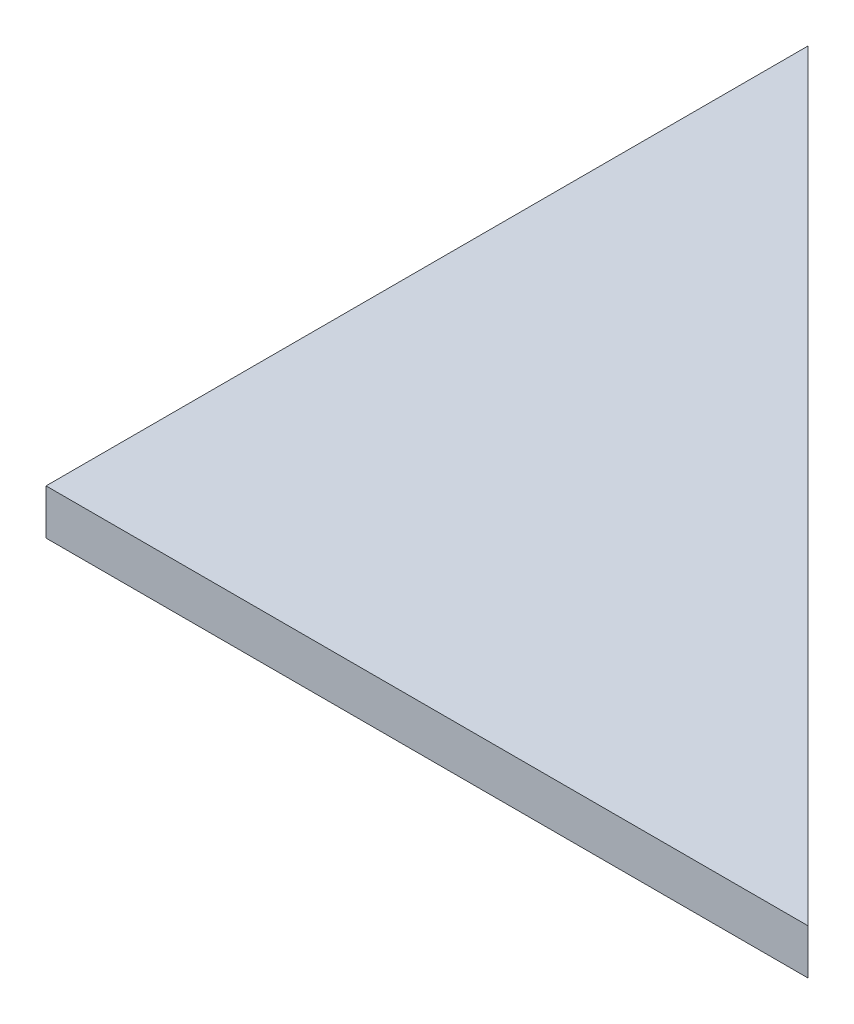
ISO-10303-21;
HEADER;
FILE_DESCRIPTION(('STEP AP214'),'2;1');
FILE_NAME('part.step','',(''),(''),'','','');
FILE_SCHEMA(('AUTOMOTIVE_DESIGN { 1 0 10303 214 1 1 1 1 }'));
ENDSEC;
DATA;
#1=APPLICATION_CONTEXT('core data for automotive mechanical design processes');
#2=APPLICATION_PROTOCOL_DEFINITION('international standard','automotive_design',2000,#1);
#3=PRODUCT_CONTEXT('',#1,'mechanical');
#4=PRODUCT('Part','Part','',(#3));
#5=PRODUCT_RELATED_PRODUCT_CATEGORY('part','',(#4));
#6=PRODUCT_DEFINITION_FORMATION('','',#4);
#7=PRODUCT_DEFINITION_CONTEXT('part definition',#1,'design');
#8=PRODUCT_DEFINITION('design','',#6,#7);
#9=PRODUCT_DEFINITION_SHAPE('','',#8);
#10=(LENGTH_UNIT() NAMED_UNIT(*) SI_UNIT(.MILLI.,.METRE.));
#11=(NAMED_UNIT(*) PLANE_ANGLE_UNIT() SI_UNIT($,.RADIAN.));
#12=(NAMED_UNIT(*) SI_UNIT($,.STERADIAN.) SOLID_ANGLE_UNIT());
#13=UNCERTAINTY_MEASURE_WITH_UNIT(LENGTH_MEASURE(1.E-05),#10,'distance_accuracy_value','');
#14=(GEOMETRIC_REPRESENTATION_CONTEXT(3) GLOBAL_UNCERTAINTY_ASSIGNED_CONTEXT((#13)) GLOBAL_UNIT_ASSIGNED_CONTEXT((#10,
#11,#12)) REPRESENTATION_CONTEXT('',''));
#15=CARTESIAN_POINT('',(0.,0.,0.));
#16=DIRECTION('',(0.,0.,1.));
#17=DIRECTION('',(1.,0.,0.));
#18=AXIS2_PLACEMENT_3D('',#15,#16,#17);
#19=CARTESIAN_POINT('',(0.,3.,-50.5));
#20=DIRECTION('',(1.,0.,0.));
#21=DIRECTION('',(0.,0.,-1.));
#22=AXIS2_PLACEMENT_3D('',#19,#20,#21);
#23=PLANE('',#22);
#24=DIRECTION('',(0.,0.,1.));
#25=VECTOR('',#24,1.);
#26=CARTESIAN_POINT('',(0.,0.,-50.5));
#27=LINE('',#26,#25);
#28=CARTESIAN_POINT('',(0.,0.,-50.5));
#29=VERTEX_POINT('',#28);
#30=CARTESIAN_POINT('',(0.,0.,0.));
#31=VERTEX_POINT('',#30);
#32=EDGE_CURVE('E83',#29,#31,#27,.T.);
#33=ORIENTED_EDGE('',*,*,#32,.T.);
#34=DIRECTION('',(0.,-1.,0.));
#35=VECTOR('',#34,1.);
#36=CARTESIAN_POINT('',(0.,3.,0.));
#37=LINE('',#36,#35);
#38=CARTESIAN_POINT('',(0.,3.,0.));
#39=VERTEX_POINT('',#38);
#40=EDGE_CURVE('E11',#39,#31,#37,.T.);
#41=ORIENTED_EDGE('',*,*,#40,.F.);
#42=DIRECTION('',(0.,0.,1.));
#43=VECTOR('',#42,1.);
#44=CARTESIAN_POINT('',(0.,3.,-50.5));
#45=LINE('',#44,#43);
#46=CARTESIAN_POINT('',(0.,3.,-50.5));
#47=VERTEX_POINT('',#46);
#48=EDGE_CURVE('E76',#47,#39,#45,.T.);
#49=ORIENTED_EDGE('',*,*,#48,.F.);
#50=DIRECTION('',(0.,-1.,0.));
#51=VECTOR('',#50,1.);
#52=CARTESIAN_POINT('',(0.,3.,-50.5));
#53=LINE('',#52,#51);
#54=EDGE_CURVE('E84',#47,#29,#53,.T.);
#55=ORIENTED_EDGE('',*,*,#54,.T.);
#56=EDGE_LOOP('',(#33,#41,#49,#55));
#57=FACE_BOUND('',#56,.T.);
#58=ADVANCED_FACE('F36',(#57),#23,.F.);
#59=CARTESIAN_POINT('',(0.,3.,0.));
#60=DIRECTION('',(0.,0.,-1.));
#61=DIRECTION('',(-1.,0.,0.));
#62=AXIS2_PLACEMENT_3D('',#59,#60,#61);
#63=PLANE('',#62);
#64=DIRECTION('',(1.,0.,0.));
#65=VECTOR('',#64,1.);
#66=CARTESIAN_POINT('',(0.,0.,0.));
#67=LINE('',#66,#65);
#68=CARTESIAN_POINT('',(50.5,0.,0.));
#69=VERTEX_POINT('',#68);
#70=EDGE_CURVE('E64',#31,#69,#67,.T.);
#71=ORIENTED_EDGE('',*,*,#70,.T.);
#72=DIRECTION('',(0.,-1.,0.));
#73=VECTOR('',#72,1.);
#74=CARTESIAN_POINT('',(50.5,3.,0.));
#75=LINE('',#74,#73);
#76=CARTESIAN_POINT('',(50.5,3.,0.));
#77=VERTEX_POINT('',#76);
#78=EDGE_CURVE('E44',#77,#69,#75,.T.);
#79=ORIENTED_EDGE('',*,*,#78,.F.);
#80=DIRECTION('',(1.,0.,0.));
#81=VECTOR('',#80,1.);
#82=CARTESIAN_POINT('',(0.,3.,0.));
#83=LINE('',#82,#81);
#84=EDGE_CURVE('E72',#39,#77,#83,.T.);
#85=ORIENTED_EDGE('',*,*,#84,.F.);
#86=ORIENTED_EDGE('',*,*,#40,.T.);
#87=EDGE_LOOP('',(#71,#79,#85,#86));
#88=FACE_BOUND('',#87,.T.);
#89=ADVANCED_FACE('F73',(#88),#63,.F.);
#90=CARTESIAN_POINT('',(50.5,3.,0.));
#91=DIRECTION('',(-0.707106781186548,0.,0.707106781186548));
#92=DIRECTION('',(0.707106781186548,0.,0.707106781186548));
#93=AXIS2_PLACEMENT_3D('',#90,#91,#92);
#94=PLANE('',#93);
#95=DIRECTION('',(-0.707106781186547,0.,-0.707106781186547));
#96=VECTOR('',#95,1.);
#97=CARTESIAN_POINT('',(50.5,0.,0.));
#98=LINE('',#97,#96);
#99=EDGE_CURVE('E69',#69,#29,#98,.T.);
#100=ORIENTED_EDGE('',*,*,#99,.T.);
#101=ORIENTED_EDGE('',*,*,#54,.F.);
#102=DIRECTION('',(-0.707106781186547,0.,-0.707106781186547));
#103=VECTOR('',#102,1.);
#104=CARTESIAN_POINT('',(50.5,3.,0.));
#105=LINE('',#104,#103);
#106=EDGE_CURVE('E52',#77,#47,#105,.T.);
#107=ORIENTED_EDGE('',*,*,#106,.F.);
#108=ORIENTED_EDGE('',*,*,#78,.T.);
#109=EDGE_LOOP('',(#100,#101,#107,#108));
#110=FACE_BOUND('',#109,.T.);
#111=ADVANCED_FACE('F91',(#110),#94,.F.);
#112=CARTESIAN_POINT('',(0.,3.,0.));
#113=DIRECTION('',(0.,1.,0.));
#114=DIRECTION('',(0.,0.,1.));
#115=AXIS2_PLACEMENT_3D('',#112,#113,#114);
#116=PLANE('',#115);
#117=ORIENTED_EDGE('',*,*,#48,.T.);
#118=ORIENTED_EDGE('',*,*,#84,.T.);
#119=ORIENTED_EDGE('',*,*,#106,.T.);
#120=EDGE_LOOP('',(#117,#118,#119));
#121=FACE_BOUND('',#120,.T.);
#122=ADVANCED_FACE('F79',(#121),#116,.T.);
#123=CARTESIAN_POINT('',(0.,0.,0.));
#124=DIRECTION('',(0.,1.,0.));
#125=DIRECTION('',(0.,0.,1.));
#126=AXIS2_PLACEMENT_3D('',#123,#124,#125);
#127=PLANE('',#126);
#128=ORIENTED_EDGE('',*,*,#32,.F.);
#129=ORIENTED_EDGE('',*,*,#99,.F.);
#130=ORIENTED_EDGE('',*,*,#70,.F.);
#131=EDGE_LOOP('',(#128,#129,#130));
#132=FACE_BOUND('',#131,.T.);
#133=ADVANCED_FACE('F92',(#132),#127,.F.);
#134=CLOSED_SHELL('',(#58,#89,#111,#122,#133));
#135=MANIFOLD_SOLID_BREP('B2',#134);
#136=ADVANCED_BREP_SHAPE_REPRESENTATION('',(#18,#135),#14);
#137=SHAPE_DEFINITION_REPRESENTATION(#9,#136);
ENDSEC;
END-ISO-10303-21;
